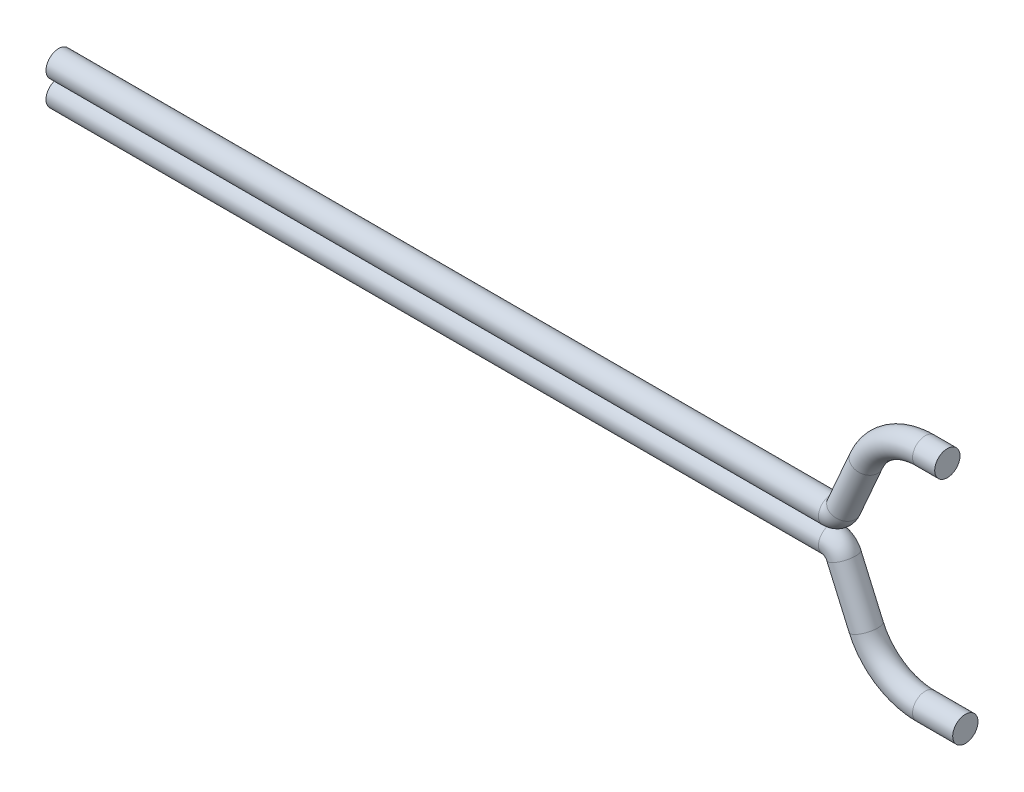
ISO-10303-21;
HEADER;
FILE_DESCRIPTION(('STEP AP214'),'2;1');
FILE_NAME('part.step','',(''),(''),'','','');
FILE_SCHEMA(('AUTOMOTIVE_DESIGN { 1 0 10303 214 1 1 1 1 }'));
ENDSEC;
DATA;
#1=APPLICATION_CONTEXT('core data for automotive mechanical design processes');
#2=APPLICATION_PROTOCOL_DEFINITION('international standard','automotive_design',2000,#1);
#3=PRODUCT_CONTEXT('',#1,'mechanical');
#4=PRODUCT('Part','Part','',(#3));
#5=PRODUCT_RELATED_PRODUCT_CATEGORY('part','',(#4));
#6=PRODUCT_DEFINITION_FORMATION('','',#4);
#7=PRODUCT_DEFINITION_CONTEXT('part definition',#1,'design');
#8=PRODUCT_DEFINITION('design','',#6,#7);
#9=PRODUCT_DEFINITION_SHAPE('','',#8);
#10=(LENGTH_UNIT() NAMED_UNIT(*) SI_UNIT(.MILLI.,.METRE.));
#11=(NAMED_UNIT(*) PLANE_ANGLE_UNIT() SI_UNIT($,.RADIAN.));
#12=(NAMED_UNIT(*) SI_UNIT($,.STERADIAN.) SOLID_ANGLE_UNIT());
#13=UNCERTAINTY_MEASURE_WITH_UNIT(LENGTH_MEASURE(1.E-05),#10,'distance_accuracy_value','');
#14=(GEOMETRIC_REPRESENTATION_CONTEXT(3) GLOBAL_UNCERTAINTY_ASSIGNED_CONTEXT((#13)) GLOBAL_UNIT_ASSIGNED_CONTEXT((#10,
#11,#12)) REPRESENTATION_CONTEXT('',''));
#15=CARTESIAN_POINT('',(0.,0.,0.));
#16=DIRECTION('',(0.,0.,1.));
#17=DIRECTION('',(1.,0.,0.));
#18=AXIS2_PLACEMENT_3D('',#15,#16,#17);
#19=CARTESIAN_POINT('',(235.91,-6.99686707171976,0.));
#20=DIRECTION('',(1.,0.,0.));
#21=DIRECTION('',(0.,0.,-1.));
#22=AXIS2_PLACEMENT_3D('',#19,#20,#21);
#23=PLANE('',#22);
#24=CARTESIAN_POINT('',(235.91,-6.99686707171976,0.));
#25=DIRECTION('',(1.,0.,0.));
#26=DIRECTION('',(0.,0.,-1.));
#27=AXIS2_PLACEMENT_3D('',#24,#25,#26);
#28=CIRCLE('',#27,0.8);
#29=CARTESIAN_POINT('',(235.91,-6.99686707171976,-0.800000000000057));
#30=VERTEX_POINT('',#29);
#31=EDGE_CURVE('P0_E18',#30,#30,#28,.F.);
#32=ORIENTED_EDGE('',*,*,#31,.F.);
#33=EDGE_LOOP('',(#32));
#34=FACE_BOUND('',#33,.T.);
#35=ADVANCED_FACE('P0_F15',(#34),#23,.T.);
#36=CARTESIAN_POINT('',(233.37,-6.99686707171976,0.));
#37=DIRECTION('',(1.,0.,0.));
#38=DIRECTION('',(0.,0.,-1.));
#39=AXIS2_PLACEMENT_3D('',#36,#37,#38);
#40=CYLINDRICAL_SURFACE('',#39,0.8);
#41=ORIENTED_EDGE('',*,*,#31,.T.);
#42=EDGE_LOOP('',(#41));
#43=FACE_BOUND('',#42,.T.);
#44=CARTESIAN_POINT('',(233.37,-6.99686707171976,0.));
#45=DIRECTION('',(1.,0.,0.));
#46=DIRECTION('',(0.,-1.,0.));
#47=AXIS2_PLACEMENT_3D('',#44,#45,#46);
#48=CIRCLE('',#47,0.8);
#49=CARTESIAN_POINT('',(233.37,-7.79686707171976,0.));
#50=VERTEX_POINT('',#49);
#51=EDGE_CURVE('P0_E59',#50,#50,#48,.F.);
#52=ORIENTED_EDGE('',*,*,#51,.F.);
#53=EDGE_LOOP('',(#52));
#54=FACE_BOUND('',#53,.T.);
#55=ADVANCED_FACE('P0_F52',(#43,#54),#40,.T.);
#56=CARTESIAN_POINT('',(233.37,-2.92071469877589,0.));
#57=DIRECTION('',(0.,0.,1.));
#58=DIRECTION('',(1.,0.,0.));
#59=AXIS2_PLACEMENT_3D('',#56,#57,#58);
#60=TOROIDAL_SURFACE('',#59,4.07615237294387,0.8);
#61=ORIENTED_EDGE('',*,*,#51,.T.);
#62=EDGE_LOOP('',(#61));
#63=FACE_BOUND('',#62,.T.);
#64=CARTESIAN_POINT('',(229.636644149097,-4.55689080726306,0.));
#65=DIRECTION('',(0.401402096581953,-0.915901936268077,0.));
#66=DIRECTION('',(0.915901936268077,0.401402096581953,0.));
#67=AXIS2_PLACEMENT_3D('',#64,#65,#66);
#68=CIRCLE('',#67,0.8);
#69=CARTESIAN_POINT('',(230.369365698112,-4.2357691299975,0.));
#70=VERTEX_POINT('',#69);
#71=EDGE_CURVE('P0_E62',#70,#70,#68,.F.);
#72=ORIENTED_EDGE('',*,*,#71,.F.);
#73=EDGE_LOOP('',(#72));
#74=FACE_BOUND('',#73,.T.);
#75=ADVANCED_FACE('P0_F48',(#63,#74),#60,.T.);
#76=CARTESIAN_POINT('',(228.220817134888,-1.32631798570251,0.));
#77=DIRECTION('',(0.401402096581953,-0.915901936268077,0.));
#78=DIRECTION('',(0.915901936268077,0.401402096581953,0.));
#79=AXIS2_PLACEMENT_3D('',#76,#77,#78);
#80=CYLINDRICAL_SURFACE('',#79,0.8);
#81=ORIENTED_EDGE('',*,*,#71,.T.);
#82=EDGE_LOOP('',(#81));
#83=FACE_BOUND('',#82,.T.);
#84=CARTESIAN_POINT('',(228.220817134887,-1.32631798570196,0.));
#85=DIRECTION('',(0.401402096582617,-0.915901936267786,0.));
#86=DIRECTION('',(0.915901936267786,0.401402096582617,0.));
#87=AXIS2_PLACEMENT_3D('',#84,#85,#86);
#88=CIRCLE('',#87,0.8);
#89=CARTESIAN_POINT('',(228.953538683902,-1.00519630843586,0.));
#90=VERTEX_POINT('',#89);
#91=EDGE_CURVE('P0_E27',#90,#90,#88,.F.);
#92=ORIENTED_EDGE('',*,*,#91,.F.);
#93=EDGE_LOOP('',(#92));
#94=FACE_BOUND('',#93,.T.);
#95=ADVANCED_FACE('P0_F44',(#83,#94),#80,.T.);
#96=CARTESIAN_POINT('',(178.542170587557,-43.2716398357761,1.27));
#97=DIRECTION('',(1.,0.,0.));
#98=DIRECTION('',(0.,0.,-1.));
#99=AXIS2_PLACEMENT_3D('',#96,#97,#98);
#100=PLANE('',#99);
#101=CARTESIAN_POINT('',(178.542170587557,-0.799999924,0.));
#102=DIRECTION('',(1.,0.,0.));
#103=DIRECTION('',(0.,0.,-1.));
#104=AXIS2_PLACEMENT_3D('',#101,#102,#103);
#105=CIRCLE('',#104,0.8);
#106=CARTESIAN_POINT('',(178.542170587557,-0.799999924,-0.799999999999978));
#107=VERTEX_POINT('',#106);
#108=EDGE_CURVE('P0_E22',#107,#107,#105,.T.);
#109=ORIENTED_EDGE('',*,*,#108,.F.);
#110=EDGE_LOOP('',(#109));
#111=FACE_BOUND('',#110,.T.);
#112=ADVANCED_FACE('P0_F40',(#111),#100,.F.);
#113=CARTESIAN_POINT('',(227.41550904902,-1.67925135254194,0.));
#114=DIRECTION('',(0.,0.,-1.));
#115=DIRECTION('',(-1.,0.,0.));
#116=AXIS2_PLACEMENT_3D('',#113,#114,#115);
#117=TOROIDAL_SURFACE('',#116,0.879251428541866,0.8);
#118=ORIENTED_EDGE('',*,*,#91,.T.);
#119=EDGE_LOOP('',(#118));
#120=FACE_BOUND('',#119,.T.);
#121=CARTESIAN_POINT('',(227.41550904902,-0.799999924,0.));
#122=DIRECTION('',(1.,0.,0.));
#123=DIRECTION('',(0.,0.,-1.));
#124=AXIS2_PLACEMENT_3D('',#121,#122,#123);
#125=CIRCLE('',#124,0.8);
#126=CARTESIAN_POINT('',(227.41550904902,-0.799999924,-0.799999999999978));
#127=VERTEX_POINT('',#126);
#128=EDGE_CURVE('P0_E10',#127,#127,#125,.F.);
#129=ORIENTED_EDGE('',*,*,#128,.F.);
#130=EDGE_LOOP('',(#129));
#131=FACE_BOUND('',#130,.T.);
#132=ADVANCED_FACE('P0_F35',(#120,#131),#117,.T.);
#133=CARTESIAN_POINT('',(6.00999999999999,-0.799999924,0.));
#134=DIRECTION('',(1.,0.,0.));
#135=DIRECTION('',(0.,0.,-1.));
#136=AXIS2_PLACEMENT_3D('',#133,#134,#135);
#137=CYLINDRICAL_SURFACE('',#136,0.8);
#138=ORIENTED_EDGE('',*,*,#128,.T.);
#139=EDGE_LOOP('',(#138));
#140=FACE_BOUND('',#139,.T.);
#141=ORIENTED_EDGE('',*,*,#108,.T.);
#142=EDGE_LOOP('',(#141));
#143=FACE_BOUND('',#142,.T.);
#144=ADVANCED_FACE('P0_F39',(#140,#143),#137,.T.);
#145=CLOSED_SHELL('',(#35,#55,#75,#95,#112,#132,#144));
#146=MANIFOLD_SOLID_BREP('P0_B1',#145);
#147=CARTESIAN_POINT('',(234.771596629543,6.9968671477208,8.55189806E-13));
#148=DIRECTION('',(1.,0.,0.));
#149=DIRECTION('',(0.,0.,-1.));
#150=AXIS2_PLACEMENT_3D('',#147,#148,#149);
#151=PLANE('',#150);
#152=CARTESIAN_POINT('',(234.771596629543,6.9968671477208,8.55189806E-13));
#153=DIRECTION('',(1.,0.,0.));
#154=DIRECTION('',(0.,0.,-1.));
#155=AXIS2_PLACEMENT_3D('',#152,#153,#154);
#156=CIRCLE('',#155,0.799999999999442);
#157=CARTESIAN_POINT('',(234.771596629543,6.9968671477208,-0.799999999998587));
#158=VERTEX_POINT('',#157);
#159=EDGE_CURVE('P1_E18',#158,#158,#156,.F.);
#160=ORIENTED_EDGE('',*,*,#159,.F.);
#161=EDGE_LOOP('',(#160));
#162=FACE_BOUND('',#161,.T.);
#163=ADVANCED_FACE('P1_F15',(#162),#151,.T.);
#164=CARTESIAN_POINT('',(233.37,6.9968671477208,8.55189806E-13));
#165=DIRECTION('',(1.,0.,0.));
#166=DIRECTION('',(0.,0.,-1.));
#167=AXIS2_PLACEMENT_3D('',#164,#165,#166);
#168=CYLINDRICAL_SURFACE('',#167,0.799999999999442);
#169=ORIENTED_EDGE('',*,*,#159,.T.);
#170=EDGE_LOOP('',(#169));
#171=FACE_BOUND('',#170,.T.);
#172=CARTESIAN_POINT('',(233.37,6.99686714772077,8.55189806E-13));
#173=DIRECTION('',(1.,0.,0.));
#174=DIRECTION('',(0.,1.,0.));
#175=AXIS2_PLACEMENT_3D('',#172,#173,#174);
#176=CIRCLE('',#175,0.799999999999442);
#177=CARTESIAN_POINT('',(233.37,7.79686714772021,8.55189806E-13));
#178=VERTEX_POINT('',#177);
#179=EDGE_CURVE('P1_E59',#178,#178,#176,.F.);
#180=ORIENTED_EDGE('',*,*,#179,.F.);
#181=EDGE_LOOP('',(#180));
#182=FACE_BOUND('',#181,.T.);
#183=ADVANCED_FACE('P1_F52',(#171,#182),#168,.T.);
#184=CARTESIAN_POINT('',(233.37,2.92071469877589,8.55189806E-13));
#185=DIRECTION('',(0.,0.,-1.));
#186=DIRECTION('',(-1.,0.,0.));
#187=AXIS2_PLACEMENT_3D('',#184,#185,#186);
#188=TOROIDAL_SURFACE('',#187,4.07615244894488,0.799999999999442);
#189=ORIENTED_EDGE('',*,*,#179,.T.);
#190=EDGE_LOOP('',(#189));
#191=FACE_BOUND('',#190,.T.);
#192=CARTESIAN_POINT('',(229.636644086407,4.55689085355806,8.55189806E-13));
#193=DIRECTION('',(0.401402116316983,0.915901927619026,0.));
#194=DIRECTION('',(-0.915901927619026,0.401402116316983,0.));
#195=AXIS2_PLACEMENT_3D('',#192,#193,#194);
#196=CIRCLE('',#195,0.799999999999467);
#197=CARTESIAN_POINT('',(228.903922544312,4.87801254661143,8.55189806E-13));
#198=VERTEX_POINT('',#197);
#199=EDGE_CURVE('P1_E62',#198,#198,#196,.F.);
#200=ORIENTED_EDGE('',*,*,#199,.F.);
#201=EDGE_LOOP('',(#200));
#202=FACE_BOUND('',#201,.T.);
#203=ADVANCED_FACE('P1_F48',(#191,#202),#188,.T.);
#204=CARTESIAN_POINT('',(228.220816995669,1.32631804671649,8.55189806E-13));
#205=DIRECTION('',(0.401402116316983,0.915901927619026,0.));
#206=DIRECTION('',(-0.915901927619026,0.401402116316983,0.));
#207=AXIS2_PLACEMENT_3D('',#204,#205,#206);
#208=CYLINDRICAL_SURFACE('',#207,0.799999999999467);
#209=ORIENTED_EDGE('',*,*,#199,.T.);
#210=EDGE_LOOP('',(#209));
#211=FACE_BOUND('',#210,.T.);
#212=CARTESIAN_POINT('',(228.220816995669,1.32631804671636,8.55189806E-13));
#213=DIRECTION('',(0.401402096582111,0.915901936268008,0.));
#214=DIRECTION('',(0.915901936268008,-0.401402096582111,0.));
#215=AXIS2_PLACEMENT_3D('',#212,#213,#214);
#216=CIRCLE('',#215,0.799999999999442);
#217=CARTESIAN_POINT('',(228.953538544682,1.0051963694509,8.55189806E-13));
#218=VERTEX_POINT('',#217);
#219=EDGE_CURVE('P1_E27',#218,#218,#216,.F.);
#220=ORIENTED_EDGE('',*,*,#219,.F.);
#221=EDGE_LOOP('',(#220));
#222=FACE_BOUND('',#221,.T.);
#223=ADVANCED_FACE('P1_F44',(#211,#222),#208,.T.);
#224=CARTESIAN_POINT('',(178.542170587557,-43.2716398357761,1.27));
#225=DIRECTION('',(1.,0.,0.));
#226=DIRECTION('',(0.,0.,-1.));
#227=AXIS2_PLACEMENT_3D('',#224,#225,#226);
#228=PLANE('',#227);
#229=CARTESIAN_POINT('',(178.542170587557,0.800000076000001,9.33498006E-13));
#230=DIRECTION('',(1.,0.,0.));
#231=DIRECTION('',(0.,0.,-1.));
#232=AXIS2_PLACEMENT_3D('',#229,#230,#231);
#233=CIRCLE('',#232,0.799999999999442);
#234=CARTESIAN_POINT('',(178.542170587557,0.800000076000001,-0.799999999998508));
#235=VERTEX_POINT('',#234);
#236=EDGE_CURVE('P1_E22',#235,#235,#233,.T.);
#237=ORIENTED_EDGE('',*,*,#236,.F.);
#238=EDGE_LOOP('',(#237));
#239=FACE_BOUND('',#238,.T.);
#240=ADVANCED_FACE('P1_F40',(#239),#228,.F.);
#241=CARTESIAN_POINT('',(227.41550904902,1.67925135254194,8.55189806E-13));
#242=DIRECTION('',(0.,0.,1.));
#243=DIRECTION('',(1.,0.,0.));
#244=AXIS2_PLACEMENT_3D('',#241,#242,#243);
#245=TOROIDAL_SURFACE('',#244,0.879251276539789,0.799999999999442);
#246=ORIENTED_EDGE('',*,*,#219,.T.);
#247=EDGE_LOOP('',(#246));
#248=FACE_BOUND('',#247,.T.);
#249=CARTESIAN_POINT('',(227.41550904902,0.800000076000001,9.33498006E-13));
#250=DIRECTION('',(1.,0.,0.));
#251=DIRECTION('',(0.,0.,-1.));
#252=AXIS2_PLACEMENT_3D('',#249,#250,#251);
#253=CIRCLE('',#252,0.799999999999442);
#254=CARTESIAN_POINT('',(227.41550904902,0.800000076000001,-0.799999999998508));
#255=VERTEX_POINT('',#254);
#256=EDGE_CURVE('P1_E10',#255,#255,#253,.F.);
#257=ORIENTED_EDGE('',*,*,#256,.F.);
#258=EDGE_LOOP('',(#257));
#259=FACE_BOUND('',#258,.T.);
#260=ADVANCED_FACE('P1_F35',(#248,#259),#245,.T.);
#261=CARTESIAN_POINT('',(6.00999999999999,0.800000076000001,9.33498006E-13));
#262=DIRECTION('',(1.,0.,0.));
#263=DIRECTION('',(0.,0.,-1.));
#264=AXIS2_PLACEMENT_3D('',#261,#262,#263);
#265=CYLINDRICAL_SURFACE('',#264,0.799999999999442);
#266=ORIENTED_EDGE('',*,*,#256,.T.);
#267=EDGE_LOOP('',(#266));
#268=FACE_BOUND('',#267,.T.);
#269=ORIENTED_EDGE('',*,*,#236,.T.);
#270=EDGE_LOOP('',(#269));
#271=FACE_BOUND('',#270,.T.);
#272=ADVANCED_FACE('P1_F39',(#268,#271),#265,.T.);
#273=CLOSED_SHELL('',(#163,#183,#203,#223,#240,#260,#272));
#274=MANIFOLD_SOLID_BREP('P1_B1',#273);
#275=ADVANCED_BREP_SHAPE_REPRESENTATION('',(#18,#146,#274),#14);
#276=SHAPE_DEFINITION_REPRESENTATION(#9,#275);
ENDSEC;
END-ISO-10303-21;
